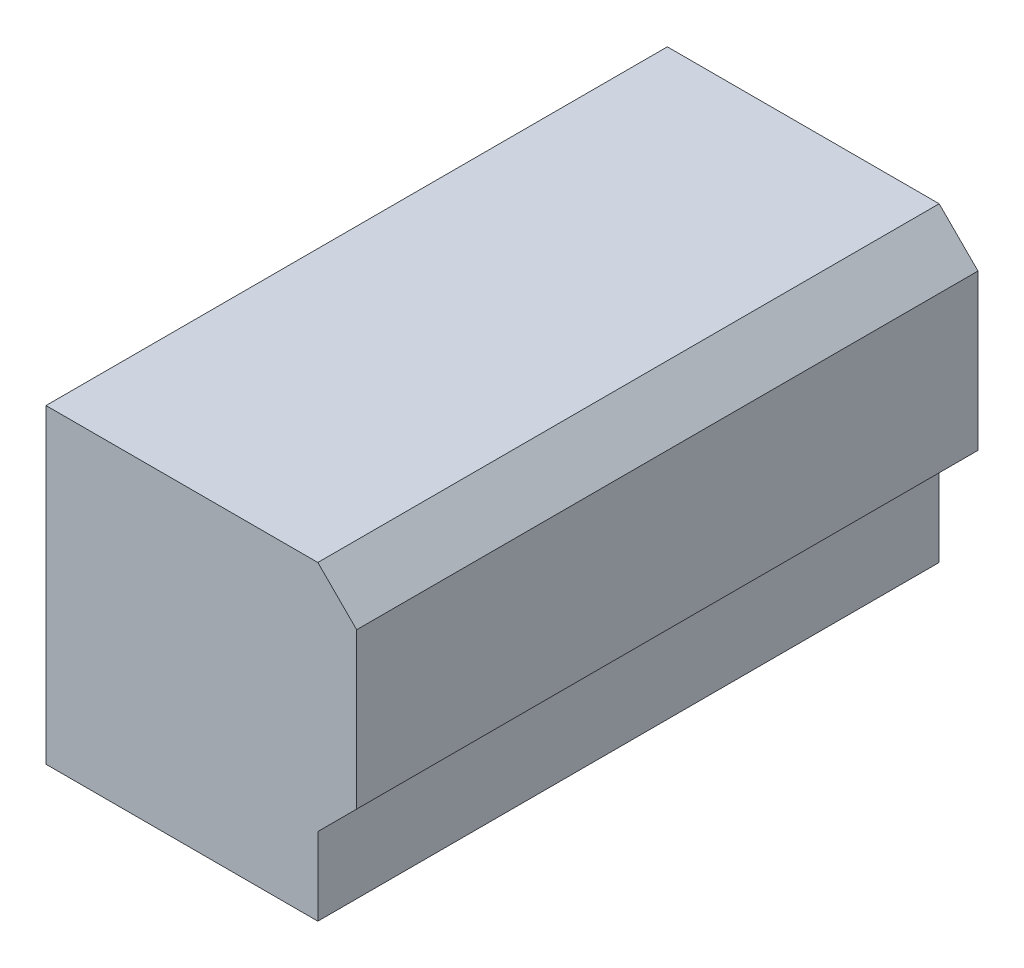
ISO-10303-21;
HEADER;
FILE_DESCRIPTION(('STEP AP214'),'2;1');
FILE_NAME('part.step','',(''),(''),'','','');
FILE_SCHEMA(('AUTOMOTIVE_DESIGN { 1 0 10303 214 1 1 1 1 }'));
ENDSEC;
DATA;
#1=APPLICATION_CONTEXT('core data for automotive mechanical design processes');
#2=APPLICATION_PROTOCOL_DEFINITION('international standard','automotive_design',2000,#1);
#3=PRODUCT_CONTEXT('',#1,'mechanical');
#4=PRODUCT('Part','Part','',(#3));
#5=PRODUCT_RELATED_PRODUCT_CATEGORY('part','',(#4));
#6=PRODUCT_DEFINITION_FORMATION('','',#4);
#7=PRODUCT_DEFINITION_CONTEXT('part definition',#1,'design');
#8=PRODUCT_DEFINITION('design','',#6,#7);
#9=PRODUCT_DEFINITION_SHAPE('','',#8);
#10=(LENGTH_UNIT() NAMED_UNIT(*) SI_UNIT(.MILLI.,.METRE.));
#11=(NAMED_UNIT(*) PLANE_ANGLE_UNIT() SI_UNIT($,.RADIAN.));
#12=(NAMED_UNIT(*) SI_UNIT($,.STERADIAN.) SOLID_ANGLE_UNIT());
#13=UNCERTAINTY_MEASURE_WITH_UNIT(LENGTH_MEASURE(1.E-05),#10,'distance_accuracy_value','');
#14=(GEOMETRIC_REPRESENTATION_CONTEXT(3) GLOBAL_UNCERTAINTY_ASSIGNED_CONTEXT((#13)) GLOBAL_UNIT_ASSIGNED_CONTEXT((#10,
#11,#12)) REPRESENTATION_CONTEXT('',''));
#15=CARTESIAN_POINT('',(0.,0.,0.));
#16=DIRECTION('',(0.,0.,1.));
#17=DIRECTION('',(1.,0.,0.));
#18=AXIS2_PLACEMENT_3D('',#15,#16,#17);
#19=CARTESIAN_POINT('',(1.00000054,-0.2499995,0.));
#20=DIRECTION('',(0.707106781186548,-0.707106781186548,0.));
#21=DIRECTION('',(0.707106781186548,0.707106781186548,0.));
#22=AXIS2_PLACEMENT_3D('',#19,#20,#21);
#23=PLANE('',#22);
#24=DIRECTION('',(0.,0.,-1.));
#25=VECTOR('',#24,1.);
#26=CARTESIAN_POINT('',(0.75000104,-0.499999,0.));
#27=LINE('',#26,#25);
#28=CARTESIAN_POINT('',(0.75000104,-0.499999,0.));
#29=VERTEX_POINT('',#28);
#30=CARTESIAN_POINT('',(0.75000104,-0.499999,3.99999962));
#31=VERTEX_POINT('',#30);
#32=EDGE_CURVE('E98',#29,#31,#27,.F.);
#33=ORIENTED_EDGE('',*,*,#32,.F.);
#34=DIRECTION('',(0.707106781186548,0.707106781186548,0.));
#35=VECTOR('',#34,1.);
#36=CARTESIAN_POINT('',(1.00000054,-0.2499995,0.));
#37=LINE('',#36,#35);
#38=CARTESIAN_POINT('',(1.00000054,-0.2499995,0.));
#39=VERTEX_POINT('',#38);
#40=EDGE_CURVE('E74',#29,#39,#37,.T.);
#41=ORIENTED_EDGE('',*,*,#40,.T.);
#42=DIRECTION('',(0.,0.,-1.));
#43=VECTOR('',#42,1.);
#44=CARTESIAN_POINT('',(1.00000054,-0.2499995,0.));
#45=LINE('',#44,#43);
#46=CARTESIAN_POINT('',(1.00000054,-0.2499995,3.99999962));
#47=VERTEX_POINT('',#46);
#48=EDGE_CURVE('E87',#47,#39,#45,.T.);
#49=ORIENTED_EDGE('',*,*,#48,.F.);
#50=DIRECTION('',(0.707106781186548,0.707106781186548,0.));
#51=VECTOR('',#50,1.);
#52=CARTESIAN_POINT('',(1.00000054,-0.2499995,3.99999962));
#53=LINE('',#52,#51);
#54=EDGE_CURVE('E20',#47,#31,#53,.F.);
#55=ORIENTED_EDGE('',*,*,#54,.T.);
#56=EDGE_LOOP('',(#33,#41,#49,#55));
#57=FACE_BOUND('',#56,.T.);
#58=ADVANCED_FACE('F17',(#57),#23,.T.);
#59=CARTESIAN_POINT('',(1.00000054,0.7499985,0.));
#60=DIRECTION('',(1.,0.,0.));
#61=DIRECTION('',(0.,0.,-1.));
#62=AXIS2_PLACEMENT_3D('',#59,#60,#61);
#63=PLANE('',#62);
#64=ORIENTED_EDGE('',*,*,#48,.T.);
#65=DIRECTION('',(0.,1.,0.));
#66=VECTOR('',#65,1.);
#67=CARTESIAN_POINT('',(1.00000054,0.7499985,0.));
#68=LINE('',#67,#66);
#69=CARTESIAN_POINT('',(1.000001175,0.750000405,0.));
#70=VERTEX_POINT('',#69);
#71=EDGE_CURVE('E89',#39,#70,#68,.T.);
#72=ORIENTED_EDGE('',*,*,#71,.T.);
#73=DIRECTION('',(0.,0.,1.));
#74=VECTOR('',#73,1.);
#75=CARTESIAN_POINT('',(1.00000308,0.75000104,0.));
#76=LINE('',#75,#74);
#77=CARTESIAN_POINT('',(1.000001175,0.750000405,3.99999962));
#78=VERTEX_POINT('',#77);
#79=EDGE_CURVE('E93',#78,#70,#76,.F.);
#80=ORIENTED_EDGE('',*,*,#79,.F.);
#81=DIRECTION('',(0.,1.,0.));
#82=VECTOR('',#81,1.);
#83=CARTESIAN_POINT('',(1.00000054,0.7499985,3.99999962));
#84=LINE('',#83,#82);
#85=EDGE_CURVE('E81',#78,#47,#84,.F.);
#86=ORIENTED_EDGE('',*,*,#85,.T.);
#87=EDGE_LOOP('',(#64,#72,#80,#86));
#88=FACE_BOUND('',#87,.T.);
#89=ADVANCED_FACE('F91',(#88),#63,.T.);
#90=CARTESIAN_POINT('',(0.75000104,-0.499999,0.));
#91=DIRECTION('',(1.,0.,0.));
#92=DIRECTION('',(0.,0.,-1.));
#93=AXIS2_PLACEMENT_3D('',#90,#91,#92);
#94=PLANE('',#93);
#95=DIRECTION('',(0.,0.,-1.));
#96=VECTOR('',#95,1.);
#97=CARTESIAN_POINT('',(0.75000104,-0.999998,0.));
#98=LINE('',#97,#96);
#99=CARTESIAN_POINT('',(0.75000104,-0.999998,0.));
#100=VERTEX_POINT('',#99);
#101=CARTESIAN_POINT('',(0.75000104,-0.999998,3.99999962));
#102=VERTEX_POINT('',#101);
#103=EDGE_CURVE('E107',#100,#102,#98,.F.);
#104=ORIENTED_EDGE('',*,*,#103,.F.);
#105=DIRECTION('',(0.,1.,0.));
#106=VECTOR('',#105,1.);
#107=CARTESIAN_POINT('',(0.75000104,-0.499999,0.));
#108=LINE('',#107,#106);
#109=EDGE_CURVE('E101',#100,#29,#108,.T.);
#110=ORIENTED_EDGE('',*,*,#109,.T.);
#111=ORIENTED_EDGE('',*,*,#32,.T.);
#112=DIRECTION('',(0.,1.,0.));
#113=VECTOR('',#112,1.);
#114=CARTESIAN_POINT('',(0.75000104,-0.499999,3.99999962));
#115=LINE('',#114,#113);
#116=EDGE_CURVE('E84',#31,#102,#115,.F.);
#117=ORIENTED_EDGE('',*,*,#116,.T.);
#118=EDGE_LOOP('',(#104,#110,#111,#117));
#119=FACE_BOUND('',#118,.T.);
#120=ADVANCED_FACE('F145',(#119),#94,.T.);
#121=CARTESIAN_POINT('',(0.75000358,1.00000054,0.));
#122=DIRECTION('',(0.707106781186548,0.707106781186548,0.));
#123=DIRECTION('',(-0.707106781186548,0.707106781186548,0.));
#124=AXIS2_PLACEMENT_3D('',#121,#122,#123);
#125=PLANE('',#124);
#126=ORIENTED_EDGE('',*,*,#79,.T.);
#127=DIRECTION('',(-0.707106781186548,0.707106781186548,0.));
#128=VECTOR('',#127,1.);
#129=CARTESIAN_POINT('',(0.75000358,1.00000054,0.));
#130=LINE('',#129,#128);
#131=CARTESIAN_POINT('',(0.75000358,1.00000054,0.));
#132=VERTEX_POINT('',#131);
#133=EDGE_CURVE('E105',#70,#132,#130,.T.);
#134=ORIENTED_EDGE('',*,*,#133,.T.);
#135=DIRECTION('',(0.,0.,1.));
#136=VECTOR('',#135,1.);
#137=CARTESIAN_POINT('',(0.75000358,1.00000054,0.));
#138=LINE('',#137,#136);
#139=CARTESIAN_POINT('',(0.75000358,1.00000054,3.99999962));
#140=VERTEX_POINT('',#139);
#141=EDGE_CURVE('E117',#140,#132,#138,.F.);
#142=ORIENTED_EDGE('',*,*,#141,.F.);
#143=DIRECTION('',(-0.707106781186548,0.707106781186548,0.));
#144=VECTOR('',#143,1.);
#145=CARTESIAN_POINT('',(1.00000308,0.75000104,3.99999962));
#146=LINE('',#145,#144);
#147=EDGE_CURVE('E112',#78,#140,#146,.T.);
#148=ORIENTED_EDGE('',*,*,#147,.F.);
#149=EDGE_LOOP('',(#126,#134,#142,#148));
#150=FACE_BOUND('',#149,.T.);
#151=ADVANCED_FACE('F136',(#150),#125,.T.);
#152=CARTESIAN_POINT('',(0.75000104,-0.999998,0.));
#153=DIRECTION('',(0.,-1.,0.));
#154=DIRECTION('',(0.,0.,-1.));
#155=AXIS2_PLACEMENT_3D('',#152,#153,#154);
#156=PLANE('',#155);
#157=DIRECTION('',(0.,0.,1.));
#158=VECTOR('',#157,1.);
#159=CARTESIAN_POINT('',(-1.00000054,-0.999998,0.));
#160=LINE('',#159,#158);
#161=CARTESIAN_POINT('',(-1.00000054,-0.999998,0.));
#162=VERTEX_POINT('',#161);
#163=CARTESIAN_POINT('',(-1.00000054,-0.999998,3.99999962));
#164=VERTEX_POINT('',#163);
#165=EDGE_CURVE('E123',#162,#164,#160,.T.);
#166=ORIENTED_EDGE('',*,*,#165,.F.);
#167=DIRECTION('',(1.,0.,0.));
#168=VECTOR('',#167,1.);
#169=CARTESIAN_POINT('',(-1.00000054,-0.999998,0.));
#170=LINE('',#169,#168);
#171=EDGE_CURVE('E119',#162,#100,#170,.T.);
#172=ORIENTED_EDGE('',*,*,#171,.T.);
#173=ORIENTED_EDGE('',*,*,#103,.T.);
#174=DIRECTION('',(1.,0.,0.));
#175=VECTOR('',#174,1.);
#176=CARTESIAN_POINT('',(-1.00000054,-0.999998,3.99999962));
#177=LINE('',#176,#175);
#178=EDGE_CURVE('E110',#164,#102,#177,.T.);
#179=ORIENTED_EDGE('',*,*,#178,.F.);
#180=EDGE_LOOP('',(#166,#172,#173,#179));
#181=FACE_BOUND('',#180,.T.);
#182=ADVANCED_FACE('F143',(#181),#156,.T.);
#183=CARTESIAN_POINT('',(-1.00000054,-0.999998,3.99999962));
#184=DIRECTION('',(0.,0.,1.));
#185=DIRECTION('',(1.,0.,0.));
#186=AXIS2_PLACEMENT_3D('',#183,#184,#185);
#187=PLANE('',#186);
#188=DIRECTION('',(1.,0.,0.));
#189=VECTOR('',#188,1.);
#190=CARTESIAN_POINT('',(-1.00000054,1.00000054,3.99999962));
#191=LINE('',#190,#189);
#192=CARTESIAN_POINT('',(-1.00000054,1.00000054,3.99999962));
#193=VERTEX_POINT('',#192);
#194=EDGE_CURVE('E114',#193,#140,#191,.T.);
#195=ORIENTED_EDGE('',*,*,#194,.F.);
#196=DIRECTION('',(0.,1.,0.));
#197=VECTOR('',#196,1.);
#198=CARTESIAN_POINT('',(-1.00000054,-0.999998,3.99999962));
#199=LINE('',#198,#197);
#200=EDGE_CURVE('E126',#164,#193,#199,.T.);
#201=ORIENTED_EDGE('',*,*,#200,.F.);
#202=ORIENTED_EDGE('',*,*,#178,.T.);
#203=ORIENTED_EDGE('',*,*,#116,.F.);
#204=ORIENTED_EDGE('',*,*,#54,.F.);
#205=ORIENTED_EDGE('',*,*,#85,.F.);
#206=ORIENTED_EDGE('',*,*,#147,.T.);
#207=EDGE_LOOP('',(#195,#201,#202,#203,#204,#205,#206));
#208=FACE_BOUND('',#207,.T.);
#209=ADVANCED_FACE('F79',(#208),#187,.T.);
#210=CARTESIAN_POINT('',(-1.00000054,1.00000054,0.));
#211=DIRECTION('',(0.,1.,0.));
#212=DIRECTION('',(0.,0.,1.));
#213=AXIS2_PLACEMENT_3D('',#210,#211,#212);
#214=PLANE('',#213);
#215=ORIENTED_EDGE('',*,*,#141,.T.);
#216=DIRECTION('',(1.,0.,0.));
#217=VECTOR('',#216,1.);
#218=CARTESIAN_POINT('',(-1.00000054,1.00000054,0.));
#219=LINE('',#218,#217);
#220=CARTESIAN_POINT('',(-1.00000054,1.00000054,0.));
#221=VERTEX_POINT('',#220);
#222=EDGE_CURVE('E35',#132,#221,#219,.F.);
#223=ORIENTED_EDGE('',*,*,#222,.T.);
#224=DIRECTION('',(0.,0.,1.));
#225=VECTOR('',#224,1.);
#226=CARTESIAN_POINT('',(-1.00000054,1.00000054,0.));
#227=LINE('',#226,#225);
#228=EDGE_CURVE('E26',#193,#221,#227,.F.);
#229=ORIENTED_EDGE('',*,*,#228,.F.);
#230=ORIENTED_EDGE('',*,*,#194,.T.);
#231=EDGE_LOOP('',(#215,#223,#229,#230));
#232=FACE_BOUND('',#231,.T.);
#233=ADVANCED_FACE('F133',(#232),#214,.T.);
#234=CARTESIAN_POINT('',(-1.00000054,-0.999998,0.));
#235=DIRECTION('',(0.,0.,1.));
#236=DIRECTION('',(1.,0.,0.));
#237=AXIS2_PLACEMENT_3D('',#234,#235,#236);
#238=PLANE('',#237);
#239=ORIENTED_EDGE('',*,*,#222,.F.);
#240=ORIENTED_EDGE('',*,*,#133,.F.);
#241=ORIENTED_EDGE('',*,*,#71,.F.);
#242=ORIENTED_EDGE('',*,*,#40,.F.);
#243=ORIENTED_EDGE('',*,*,#109,.F.);
#244=ORIENTED_EDGE('',*,*,#171,.F.);
#245=DIRECTION('',(0.,1.,0.));
#246=VECTOR('',#245,1.);
#247=CARTESIAN_POINT('',(-1.00000054,-0.999998,0.));
#248=LINE('',#247,#246);
#249=EDGE_CURVE('E11',#221,#162,#248,.F.);
#250=ORIENTED_EDGE('',*,*,#249,.F.);
#251=EDGE_LOOP('',(#239,#240,#241,#242,#243,#244,#250));
#252=FACE_BOUND('',#251,.T.);
#253=ADVANCED_FACE('F139',(#252),#238,.F.);
#254=CARTESIAN_POINT('',(-1.00000054,-0.999998,0.));
#255=DIRECTION('',(-1.,0.,0.));
#256=DIRECTION('',(0.,0.,1.));
#257=AXIS2_PLACEMENT_3D('',#254,#255,#256);
#258=PLANE('',#257);
#259=ORIENTED_EDGE('',*,*,#228,.T.);
#260=ORIENTED_EDGE('',*,*,#249,.T.);
#261=ORIENTED_EDGE('',*,*,#165,.T.);
#262=ORIENTED_EDGE('',*,*,#200,.T.);
#263=EDGE_LOOP('',(#259,#260,#261,#262));
#264=FACE_BOUND('',#263,.T.);
#265=ADVANCED_FACE('F131',(#264),#258,.T.);
#266=CLOSED_SHELL('',(#58,#89,#120,#151,#182,#209,#233,#253,#265));
#267=MANIFOLD_SOLID_BREP('B1',#266);
#268=ADVANCED_BREP_SHAPE_REPRESENTATION('',(#18,#267),#14);
#269=SHAPE_DEFINITION_REPRESENTATION(#9,#268);
ENDSEC;
END-ISO-10303-21;
